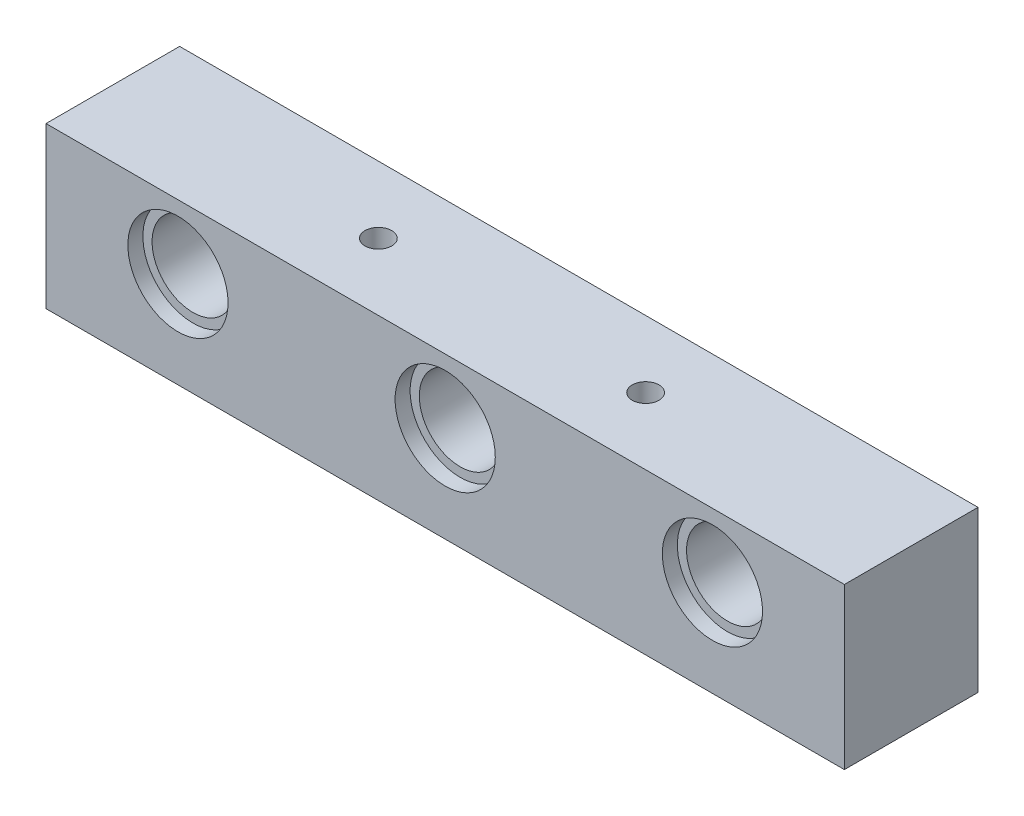
ISO-10303-21;
HEADER;
FILE_DESCRIPTION(('STEP AP214'),'2;1');
FILE_NAME('part.step','',(''),(''),'','','');
FILE_SCHEMA(('AUTOMOTIVE_DESIGN { 1 0 10303 214 1 1 1 1 }'));
ENDSEC;
DATA;
#1=APPLICATION_CONTEXT('core data for automotive mechanical design processes');
#2=APPLICATION_PROTOCOL_DEFINITION('international standard','automotive_design',2000,#1);
#3=PRODUCT_CONTEXT('',#1,'mechanical');
#4=PRODUCT('Part','Part','',(#3));
#5=PRODUCT_RELATED_PRODUCT_CATEGORY('part','',(#4));
#6=PRODUCT_DEFINITION_FORMATION('','',#4);
#7=PRODUCT_DEFINITION_CONTEXT('part definition',#1,'design');
#8=PRODUCT_DEFINITION('design','',#6,#7);
#9=PRODUCT_DEFINITION_SHAPE('','',#8);
#10=(LENGTH_UNIT() NAMED_UNIT(*) SI_UNIT(.MILLI.,.METRE.));
#11=(NAMED_UNIT(*) PLANE_ANGLE_UNIT() SI_UNIT($,.RADIAN.));
#12=(NAMED_UNIT(*) SI_UNIT($,.STERADIAN.) SOLID_ANGLE_UNIT());
#13=UNCERTAINTY_MEASURE_WITH_UNIT(LENGTH_MEASURE(1.E-05),#10,'distance_accuracy_value','');
#14=(GEOMETRIC_REPRESENTATION_CONTEXT(3) GLOBAL_UNCERTAINTY_ASSIGNED_CONTEXT((#13)) GLOBAL_UNIT_ASSIGNED_CONTEXT((#10,
#11,#12)) REPRESENTATION_CONTEXT('',''));
#15=CARTESIAN_POINT('',(0.,0.,0.));
#16=DIRECTION('',(0.,0.,1.));
#17=DIRECTION('',(1.,0.,0.));
#18=AXIS2_PLACEMENT_3D('',#15,#16,#17);
#19=CARTESIAN_POINT('',(0.,0.,-4.));
#20=DIRECTION('',(0.,0.,1.));
#21=DIRECTION('',(1.,0.,0.));
#22=AXIS2_PLACEMENT_3D('',#19,#20,#21);
#23=PLANE('',#22);
#24=CARTESIAN_POINT('',(0.,0.95,-4.));
#25=DIRECTION('',(0.,0.,1.));
#26=DIRECTION('',(1.,0.,0.));
#27=AXIS2_PLACEMENT_3D('',#24,#25,#26);
#28=CIRCLE('',#27,3.);
#29=CARTESIAN_POINT('',(3.,0.95,-4.));
#30=VERTEX_POINT('',#29);
#31=EDGE_CURVE('E151',#30,#30,#28,.T.);
#32=ORIENTED_EDGE('',*,*,#31,.T.);
#33=EDGE_LOOP('',(#32));
#34=FACE_BOUND('',#33,.T.);
#35=DIRECTION('',(0.,-1.,0.));
#36=VECTOR('',#35,1.);
#37=CARTESIAN_POINT('',(-23.9,4.8,-4.));
#38=LINE('',#37,#36);
#39=CARTESIAN_POINT('',(-23.9,4.8,-4.));
#40=VERTEX_POINT('',#39);
#41=CARTESIAN_POINT('',(-23.9,-4.8,-4.));
#42=VERTEX_POINT('',#41);
#43=EDGE_CURVE('E101',#40,#42,#38,.T.);
#44=ORIENTED_EDGE('',*,*,#43,.F.);
#45=DIRECTION('',(-1.,0.,0.));
#46=VECTOR('',#45,1.);
#47=CARTESIAN_POINT('',(-23.9,4.8,-4.));
#48=LINE('',#47,#46);
#49=CARTESIAN_POINT('',(23.9,4.8,-4.));
#50=VERTEX_POINT('',#49);
#51=EDGE_CURVE('E77',#50,#40,#48,.T.);
#52=ORIENTED_EDGE('',*,*,#51,.F.);
#53=DIRECTION('',(0.,1.,0.));
#54=VECTOR('',#53,1.);
#55=CARTESIAN_POINT('',(23.9,4.8,-4.));
#56=LINE('',#55,#54);
#57=CARTESIAN_POINT('',(23.9,-4.8,-4.));
#58=VERTEX_POINT('',#57);
#59=EDGE_CURVE('E71',#58,#50,#56,.T.);
#60=ORIENTED_EDGE('',*,*,#59,.F.);
#61=DIRECTION('',(1.,0.,0.));
#62=VECTOR('',#61,1.);
#63=CARTESIAN_POINT('',(-23.9,-4.8,-4.));
#64=LINE('',#63,#62);
#65=EDGE_CURVE('E93',#42,#58,#64,.T.);
#66=ORIENTED_EDGE('',*,*,#65,.F.);
#67=EDGE_LOOP('',(#44,#52,#60,#66));
#68=FACE_BOUND('',#67,.T.);
#69=CARTESIAN_POINT('',(-16.,0.95,-4.));
#70=DIRECTION('',(0.,0.,1.));
#71=DIRECTION('',(1.,0.,0.));
#72=AXIS2_PLACEMENT_3D('',#69,#70,#71);
#73=CIRCLE('',#72,3.);
#74=CARTESIAN_POINT('',(-13.,0.95,-4.));
#75=VERTEX_POINT('',#74);
#76=EDGE_CURVE('E142',#75,#75,#73,.T.);
#77=ORIENTED_EDGE('',*,*,#76,.T.);
#78=EDGE_LOOP('',(#77));
#79=FACE_BOUND('',#78,.T.);
#80=CARTESIAN_POINT('',(16.,0.95,-4.));
#81=DIRECTION('',(0.,0.,1.));
#82=DIRECTION('',(1.,0.,0.));
#83=AXIS2_PLACEMENT_3D('',#80,#81,#82);
#84=CIRCLE('',#83,3.);
#85=CARTESIAN_POINT('',(19.,0.95,-4.));
#86=VERTEX_POINT('',#85);
#87=EDGE_CURVE('E160',#86,#86,#84,.T.);
#88=ORIENTED_EDGE('',*,*,#87,.T.);
#89=EDGE_LOOP('',(#88));
#90=FACE_BOUND('',#89,.T.);
#91=ADVANCED_FACE('F37',(#34,#68,#79,#90),#23,.F.);
#92=CARTESIAN_POINT('',(16.,0.95,-4.));
#93=DIRECTION('',(0.,0.,1.));
#94=DIRECTION('',(1.,0.,0.));
#95=AXIS2_PLACEMENT_3D('',#92,#93,#94);
#96=CYLINDRICAL_SURFACE('',#95,2.45);
#97=CARTESIAN_POINT('',(16.,0.95,3.1));
#98=DIRECTION('',(0.,0.,1.));
#99=DIRECTION('',(1.,0.,0.));
#100=AXIS2_PLACEMENT_3D('',#97,#98,#99);
#101=CIRCLE('',#100,2.45);
#102=CARTESIAN_POINT('',(18.45,0.95,3.1));
#103=VERTEX_POINT('',#102);
#104=EDGE_CURVE('E136',#103,#103,#101,.T.);
#105=ORIENTED_EDGE('',*,*,#104,.T.);
#106=EDGE_LOOP('',(#105));
#107=FACE_BOUND('',#106,.T.);
#108=CARTESIAN_POINT('',(16.,0.95,-3.1));
#109=DIRECTION('',(0.,0.,1.));
#110=DIRECTION('',(1.,0.,0.));
#111=AXIS2_PLACEMENT_3D('',#108,#109,#110);
#112=CIRCLE('',#111,2.45);
#113=CARTESIAN_POINT('',(18.45,0.95,-3.1));
#114=VERTEX_POINT('',#113);
#115=EDGE_CURVE('E163',#114,#114,#112,.T.);
#116=ORIENTED_EDGE('',*,*,#115,.F.);
#117=EDGE_LOOP('',(#116));
#118=FACE_BOUND('',#117,.T.);
#119=ADVANCED_FACE('F261',(#107,#118),#96,.F.);
#120=CARTESIAN_POINT('',(0.,0.95,-4.));
#121=DIRECTION('',(0.,0.,1.));
#122=DIRECTION('',(1.,0.,0.));
#123=AXIS2_PLACEMENT_3D('',#120,#121,#122);
#124=CYLINDRICAL_SURFACE('',#123,2.45);
#125=CARTESIAN_POINT('',(0.,0.95,3.1));
#126=DIRECTION('',(0.,0.,1.));
#127=DIRECTION('',(1.,0.,0.));
#128=AXIS2_PLACEMENT_3D('',#125,#126,#127);
#129=CIRCLE('',#128,2.45);
#130=CARTESIAN_POINT('',(2.45,0.95,3.1));
#131=VERTEX_POINT('',#130);
#132=EDGE_CURVE('E127',#131,#131,#129,.T.);
#133=ORIENTED_EDGE('',*,*,#132,.T.);
#134=EDGE_LOOP('',(#133));
#135=FACE_BOUND('',#134,.T.);
#136=CARTESIAN_POINT('',(0.,0.95,-3.1));
#137=DIRECTION('',(0.,0.,1.));
#138=DIRECTION('',(1.,0.,0.));
#139=AXIS2_PLACEMENT_3D('',#136,#137,#138);
#140=CIRCLE('',#139,2.45);
#141=CARTESIAN_POINT('',(2.45,0.95,-3.1));
#142=VERTEX_POINT('',#141);
#143=EDGE_CURVE('E154',#142,#142,#140,.T.);
#144=ORIENTED_EDGE('',*,*,#143,.F.);
#145=EDGE_LOOP('',(#144));
#146=FACE_BOUND('',#145,.T.);
#147=ADVANCED_FACE('F269',(#135,#146),#124,.F.);
#148=CARTESIAN_POINT('',(-16.,0.95,-4.));
#149=DIRECTION('',(0.,0.,1.));
#150=DIRECTION('',(1.,0.,0.));
#151=AXIS2_PLACEMENT_3D('',#148,#149,#150);
#152=CYLINDRICAL_SURFACE('',#151,2.45);
#153=CARTESIAN_POINT('',(-16.,0.95,3.1));
#154=DIRECTION('',(0.,0.,1.));
#155=DIRECTION('',(1.,0.,0.));
#156=AXIS2_PLACEMENT_3D('',#153,#154,#155);
#157=CIRCLE('',#156,2.45);
#158=CARTESIAN_POINT('',(-13.55,0.95,3.1));
#159=VERTEX_POINT('',#158);
#160=EDGE_CURVE('E118',#159,#159,#157,.T.);
#161=ORIENTED_EDGE('',*,*,#160,.T.);
#162=EDGE_LOOP('',(#161));
#163=FACE_BOUND('',#162,.T.);
#164=CARTESIAN_POINT('',(-16.,0.95,-3.1));
#165=DIRECTION('',(0.,0.,1.));
#166=DIRECTION('',(1.,0.,0.));
#167=AXIS2_PLACEMENT_3D('',#164,#165,#166);
#168=CIRCLE('',#167,2.45);
#169=CARTESIAN_POINT('',(-13.55,0.95,-3.1));
#170=VERTEX_POINT('',#169);
#171=EDGE_CURVE('E145',#170,#170,#168,.T.);
#172=ORIENTED_EDGE('',*,*,#171,.F.);
#173=EDGE_LOOP('',(#172));
#174=FACE_BOUND('',#173,.T.);
#175=ADVANCED_FACE('F319',(#163,#174),#152,.F.);
#176=CARTESIAN_POINT('',(-23.9,4.8,4.));
#177=DIRECTION('',(1.,0.,0.));
#178=DIRECTION('',(0.,0.,-1.));
#179=AXIS2_PLACEMENT_3D('',#176,#177,#178);
#180=PLANE('',#179);
#181=ORIENTED_EDGE('',*,*,#43,.T.);
#182=DIRECTION('',(0.,0.,-1.));
#183=VECTOR('',#182,1.);
#184=CARTESIAN_POINT('',(-23.9,-4.8,4.));
#185=LINE('',#184,#183);
#186=CARTESIAN_POINT('',(-23.9,-4.8,4.));
#187=VERTEX_POINT('',#186);
#188=EDGE_CURVE('E11',#187,#42,#185,.T.);
#189=ORIENTED_EDGE('',*,*,#188,.F.);
#190=DIRECTION('',(0.,-1.,0.));
#191=VECTOR('',#190,1.);
#192=CARTESIAN_POINT('',(-23.9,4.8,4.));
#193=LINE('',#192,#191);
#194=CARTESIAN_POINT('',(-23.9,4.8,4.));
#195=VERTEX_POINT('',#194);
#196=EDGE_CURVE('E89',#195,#187,#193,.T.);
#197=ORIENTED_EDGE('',*,*,#196,.F.);
#198=DIRECTION('',(0.,0.,-1.));
#199=VECTOR('',#198,1.);
#200=CARTESIAN_POINT('',(-23.9,4.8,4.));
#201=LINE('',#200,#199);
#202=EDGE_CURVE('E97',#195,#40,#201,.T.);
#203=ORIENTED_EDGE('',*,*,#202,.T.);
#204=EDGE_LOOP('',(#181,#189,#197,#203));
#205=FACE_BOUND('',#204,.T.);
#206=ADVANCED_FACE('F39',(#205),#180,.F.);
#207=CARTESIAN_POINT('',(-23.9,-4.8,4.));
#208=DIRECTION('',(0.,1.,0.));
#209=DIRECTION('',(0.,0.,1.));
#210=AXIS2_PLACEMENT_3D('',#207,#208,#209);
#211=PLANE('',#210);
#212=CARTESIAN_POINT('',(20.,-4.8,0.));
#213=DIRECTION('',(0.,-1.,0.));
#214=DIRECTION('',(0.,0.,-1.));
#215=AXIS2_PLACEMENT_3D('',#212,#213,#214);
#216=CIRCLE('',#215,2.45);
#217=CARTESIAN_POINT('',(20.,-4.8,-2.45));
#218=VERTEX_POINT('',#217);
#219=EDGE_CURVE('E211',#218,#218,#216,.T.);
#220=ORIENTED_EDGE('',*,*,#219,.F.);
#221=EDGE_LOOP('',(#220));
#222=FACE_BOUND('',#221,.T.);
#223=CARTESIAN_POINT('',(12.,-4.8,0.));
#224=DIRECTION('',(0.,-1.,0.));
#225=DIRECTION('',(0.,0.,-1.));
#226=AXIS2_PLACEMENT_3D('',#223,#224,#225);
#227=CIRCLE('',#226,2.45);
#228=CARTESIAN_POINT('',(12.,-4.8,-2.45));
#229=VERTEX_POINT('',#228);
#230=EDGE_CURVE('E205',#229,#229,#227,.T.);
#231=ORIENTED_EDGE('',*,*,#230,.F.);
#232=EDGE_LOOP('',(#231));
#233=FACE_BOUND('',#232,.T.);
#234=CARTESIAN_POINT('',(4.,-4.8,0.));
#235=DIRECTION('',(0.,-1.,0.));
#236=DIRECTION('',(0.,0.,-1.));
#237=AXIS2_PLACEMENT_3D('',#234,#235,#236);
#238=CIRCLE('',#237,2.45);
#239=CARTESIAN_POINT('',(4.,-4.8,-2.45));
#240=VERTEX_POINT('',#239);
#241=EDGE_CURVE('E199',#240,#240,#238,.T.);
#242=ORIENTED_EDGE('',*,*,#241,.F.);
#243=EDGE_LOOP('',(#242));
#244=FACE_BOUND('',#243,.T.);
#245=CARTESIAN_POINT('',(-12.,-4.8,0.));
#246=DIRECTION('',(0.,-1.,0.));
#247=DIRECTION('',(0.,0.,-1.));
#248=AXIS2_PLACEMENT_3D('',#245,#246,#247);
#249=CIRCLE('',#248,2.45);
#250=CARTESIAN_POINT('',(-12.,-4.8,-2.45));
#251=VERTEX_POINT('',#250);
#252=EDGE_CURVE('E193',#251,#251,#249,.T.);
#253=ORIENTED_EDGE('',*,*,#252,.F.);
#254=EDGE_LOOP('',(#253));
#255=FACE_BOUND('',#254,.T.);
#256=CARTESIAN_POINT('',(-4.,-4.8,0.));
#257=DIRECTION('',(0.,-1.,0.));
#258=DIRECTION('',(0.,0.,-1.));
#259=AXIS2_PLACEMENT_3D('',#256,#257,#258);
#260=CIRCLE('',#259,2.45);
#261=CARTESIAN_POINT('',(-4.,-4.8,-2.45));
#262=VERTEX_POINT('',#261);
#263=EDGE_CURVE('E187',#262,#262,#260,.T.);
#264=ORIENTED_EDGE('',*,*,#263,.F.);
#265=EDGE_LOOP('',(#264));
#266=FACE_BOUND('',#265,.T.);
#267=CARTESIAN_POINT('',(-20.,-4.8,0.));
#268=DIRECTION('',(0.,-1.,0.));
#269=DIRECTION('',(0.,0.,-1.));
#270=AXIS2_PLACEMENT_3D('',#267,#268,#269);
#271=CIRCLE('',#270,2.45);
#272=CARTESIAN_POINT('',(-20.,-4.8,-2.45));
#273=VERTEX_POINT('',#272);
#274=EDGE_CURVE('E181',#273,#273,#271,.T.);
#275=ORIENTED_EDGE('',*,*,#274,.F.);
#276=EDGE_LOOP('',(#275));
#277=FACE_BOUND('',#276,.T.);
#278=CARTESIAN_POINT('',(8.,-4.8,0.));
#279=DIRECTION('',(0.,-1.,0.));
#280=DIRECTION('',(0.,0.,-1.));
#281=AXIS2_PLACEMENT_3D('',#278,#279,#280);
#282=CIRCLE('',#281,0.799999999999988);
#283=CARTESIAN_POINT('',(8.,-4.8,-0.799999999999987));
#284=VERTEX_POINT('',#283);
#285=EDGE_CURVE('E177',#284,#284,#282,.T.);
#286=ORIENTED_EDGE('',*,*,#285,.F.);
#287=EDGE_LOOP('',(#286));
#288=FACE_BOUND('',#287,.T.);
#289=CARTESIAN_POINT('',(-8.,-4.8,0.));
#290=DIRECTION('',(0.,-1.,0.));
#291=DIRECTION('',(0.,0.,-1.));
#292=AXIS2_PLACEMENT_3D('',#289,#290,#291);
#293=CIRCLE('',#292,0.799999999999988);
#294=CARTESIAN_POINT('',(-8.,-4.8,-0.799999999999987));
#295=VERTEX_POINT('',#294);
#296=EDGE_CURVE('E171',#295,#295,#293,.T.);
#297=ORIENTED_EDGE('',*,*,#296,.F.);
#298=EDGE_LOOP('',(#297));
#299=FACE_BOUND('',#298,.T.);
#300=ORIENTED_EDGE('',*,*,#65,.T.);
#301=DIRECTION('',(0.,0.,-1.));
#302=VECTOR('',#301,1.);
#303=CARTESIAN_POINT('',(23.9,-4.8,4.));
#304=LINE('',#303,#302);
#305=CARTESIAN_POINT('',(23.9,-4.8,4.));
#306=VERTEX_POINT('',#305);
#307=EDGE_CURVE('E46',#306,#58,#304,.T.);
#308=ORIENTED_EDGE('',*,*,#307,.F.);
#309=DIRECTION('',(1.,0.,0.));
#310=VECTOR('',#309,1.);
#311=CARTESIAN_POINT('',(-23.9,-4.8,4.));
#312=LINE('',#311,#310);
#313=EDGE_CURVE('E84',#187,#306,#312,.T.);
#314=ORIENTED_EDGE('',*,*,#313,.F.);
#315=ORIENTED_EDGE('',*,*,#188,.T.);
#316=EDGE_LOOP('',(#300,#308,#314,#315));
#317=FACE_BOUND('',#316,.T.);
#318=ADVANCED_FACE('F92',(#222,#233,#244,#255,#266,#277,#288,#299,#317),#211,.F.);
#319=CARTESIAN_POINT('',(23.9,4.8,4.));
#320=DIRECTION('',(-1.,0.,0.));
#321=DIRECTION('',(0.,0.,1.));
#322=AXIS2_PLACEMENT_3D('',#319,#320,#321);
#323=PLANE('',#322);
#324=ORIENTED_EDGE('',*,*,#59,.T.);
#325=DIRECTION('',(0.,0.,-1.));
#326=VECTOR('',#325,1.);
#327=CARTESIAN_POINT('',(23.9,4.8,4.));
#328=LINE('',#327,#326);
#329=CARTESIAN_POINT('',(23.9,4.8,4.));
#330=VERTEX_POINT('',#329);
#331=EDGE_CURVE('E94',#330,#50,#328,.T.);
#332=ORIENTED_EDGE('',*,*,#331,.F.);
#333=DIRECTION('',(0.,1.,0.));
#334=VECTOR('',#333,1.);
#335=CARTESIAN_POINT('',(23.9,4.8,4.));
#336=LINE('',#335,#334);
#337=EDGE_CURVE('E87',#306,#330,#336,.T.);
#338=ORIENTED_EDGE('',*,*,#337,.F.);
#339=ORIENTED_EDGE('',*,*,#307,.T.);
#340=EDGE_LOOP('',(#324,#332,#338,#339));
#341=FACE_BOUND('',#340,.T.);
#342=ADVANCED_FACE('F95',(#341),#323,.F.);
#343=CARTESIAN_POINT('',(-23.9,4.8,4.));
#344=DIRECTION('',(0.,-1.,0.));
#345=DIRECTION('',(0.,0.,-1.));
#346=AXIS2_PLACEMENT_3D('',#343,#344,#345);
#347=PLANE('',#346);
#348=CARTESIAN_POINT('',(8.,4.8,0.));
#349=DIRECTION('',(0.,-1.,0.));
#350=DIRECTION('',(0.,0.,-1.));
#351=AXIS2_PLACEMENT_3D('',#348,#349,#350);
#352=CIRCLE('',#351,0.799999999999999);
#353=CARTESIAN_POINT('',(8.,4.8,-0.799999999999998));
#354=VERTEX_POINT('',#353);
#355=EDGE_CURVE('E174',#354,#354,#352,.T.);
#356=ORIENTED_EDGE('',*,*,#355,.T.);
#357=EDGE_LOOP('',(#356));
#358=FACE_BOUND('',#357,.T.);
#359=CARTESIAN_POINT('',(-8.,4.8,0.));
#360=DIRECTION('',(0.,-1.,0.));
#361=DIRECTION('',(0.,0.,-1.));
#362=AXIS2_PLACEMENT_3D('',#359,#360,#361);
#363=CIRCLE('',#362,0.799999999999998);
#364=CARTESIAN_POINT('',(-8.,4.8,-0.799999999999997));
#365=VERTEX_POINT('',#364);
#366=EDGE_CURVE('E168',#365,#365,#363,.T.);
#367=ORIENTED_EDGE('',*,*,#366,.T.);
#368=EDGE_LOOP('',(#367));
#369=FACE_BOUND('',#368,.T.);
#370=ORIENTED_EDGE('',*,*,#51,.T.);
#371=ORIENTED_EDGE('',*,*,#202,.F.);
#372=DIRECTION('',(-1.,0.,0.));
#373=VECTOR('',#372,1.);
#374=CARTESIAN_POINT('',(-23.9,4.8,4.));
#375=LINE('',#374,#373);
#376=EDGE_CURVE('E54',#330,#195,#375,.T.);
#377=ORIENTED_EDGE('',*,*,#376,.F.);
#378=ORIENTED_EDGE('',*,*,#331,.T.);
#379=EDGE_LOOP('',(#370,#371,#377,#378));
#380=FACE_BOUND('',#379,.T.);
#381=ADVANCED_FACE('F109',(#358,#369,#380),#347,.F.);
#382=CARTESIAN_POINT('',(0.,0.,4.));
#383=DIRECTION('',(0.,0.,1.));
#384=DIRECTION('',(1.,0.,0.));
#385=AXIS2_PLACEMENT_3D('',#382,#383,#384);
#386=PLANE('',#385);
#387=CARTESIAN_POINT('',(16.,0.95,4.));
#388=DIRECTION('',(0.,0.,1.));
#389=DIRECTION('',(1.,0.,0.));
#390=AXIS2_PLACEMENT_3D('',#387,#388,#389);
#391=CIRCLE('',#390,3.);
#392=CARTESIAN_POINT('',(19.,0.95,4.));
#393=VERTEX_POINT('',#392);
#394=EDGE_CURVE('E133',#393,#393,#391,.T.);
#395=ORIENTED_EDGE('',*,*,#394,.F.);
#396=EDGE_LOOP('',(#395));
#397=FACE_BOUND('',#396,.T.);
#398=CARTESIAN_POINT('',(0.,0.95,4.));
#399=DIRECTION('',(0.,0.,1.));
#400=DIRECTION('',(1.,0.,0.));
#401=AXIS2_PLACEMENT_3D('',#398,#399,#400);
#402=CIRCLE('',#401,3.);
#403=CARTESIAN_POINT('',(3.,0.95,4.));
#404=VERTEX_POINT('',#403);
#405=EDGE_CURVE('E124',#404,#404,#402,.T.);
#406=ORIENTED_EDGE('',*,*,#405,.F.);
#407=EDGE_LOOP('',(#406));
#408=FACE_BOUND('',#407,.T.);
#409=CARTESIAN_POINT('',(-16.,0.95,4.));
#410=DIRECTION('',(0.,0.,1.));
#411=DIRECTION('',(1.,0.,0.));
#412=AXIS2_PLACEMENT_3D('',#409,#410,#411);
#413=CIRCLE('',#412,3.);
#414=CARTESIAN_POINT('',(-13.,0.95,4.));
#415=VERTEX_POINT('',#414);
#416=EDGE_CURVE('E115',#415,#415,#413,.T.);
#417=ORIENTED_EDGE('',*,*,#416,.F.);
#418=EDGE_LOOP('',(#417));
#419=FACE_BOUND('',#418,.T.);
#420=ORIENTED_EDGE('',*,*,#196,.T.);
#421=ORIENTED_EDGE('',*,*,#313,.T.);
#422=ORIENTED_EDGE('',*,*,#337,.T.);
#423=ORIENTED_EDGE('',*,*,#376,.T.);
#424=EDGE_LOOP('',(#420,#421,#422,#423));
#425=FACE_BOUND('',#424,.T.);
#426=ADVANCED_FACE('F85',(#397,#408,#419,#425),#386,.T.);
#427=CARTESIAN_POINT('',(-16.,0.95,3.1));
#428=DIRECTION('',(0.,0.,1.));
#429=DIRECTION('',(1.,0.,0.));
#430=AXIS2_PLACEMENT_3D('',#427,#428,#429);
#431=CYLINDRICAL_SURFACE('',#430,3.);
#432=CARTESIAN_POINT('',(-16.,0.95,3.1));
#433=DIRECTION('',(0.,0.,1.));
#434=DIRECTION('',(1.,0.,0.));
#435=AXIS2_PLACEMENT_3D('',#432,#433,#434);
#436=CIRCLE('',#435,3.);
#437=CARTESIAN_POINT('',(-13.,0.95,3.1));
#438=VERTEX_POINT('',#437);
#439=EDGE_CURVE('E104',#438,#438,#436,.T.);
#440=ORIENTED_EDGE('',*,*,#439,.F.);
#441=EDGE_LOOP('',(#440));
#442=FACE_BOUND('',#441,.T.);
#443=ORIENTED_EDGE('',*,*,#416,.T.);
#444=EDGE_LOOP('',(#443));
#445=FACE_BOUND('',#444,.T.);
#446=ADVANCED_FACE('F301',(#442,#445),#431,.F.);
#447=CARTESIAN_POINT('',(-16.,0.95,3.1));
#448=DIRECTION('',(0.,0.,1.));
#449=DIRECTION('',(1.,0.,0.));
#450=AXIS2_PLACEMENT_3D('',#447,#448,#449);
#451=PLANE('',#450);
#452=ORIENTED_EDGE('',*,*,#160,.F.);
#453=EDGE_LOOP('',(#452));
#454=FACE_BOUND('',#453,.T.);
#455=ORIENTED_EDGE('',*,*,#439,.T.);
#456=EDGE_LOOP('',(#455));
#457=FACE_BOUND('',#456,.T.);
#458=ADVANCED_FACE('F333',(#454,#457),#451,.T.);
#459=CARTESIAN_POINT('',(0.,0.95,3.1));
#460=DIRECTION('',(0.,0.,1.));
#461=DIRECTION('',(1.,0.,0.));
#462=AXIS2_PLACEMENT_3D('',#459,#460,#461);
#463=CYLINDRICAL_SURFACE('',#462,3.);
#464=CARTESIAN_POINT('',(0.,0.95,3.1));
#465=DIRECTION('',(0.,0.,1.));
#466=DIRECTION('',(1.,0.,0.));
#467=AXIS2_PLACEMENT_3D('',#464,#465,#466);
#468=CIRCLE('',#467,3.);
#469=CARTESIAN_POINT('',(3.,0.95,3.1));
#470=VERTEX_POINT('',#469);
#471=EDGE_CURVE('E123',#470,#470,#468,.T.);
#472=ORIENTED_EDGE('',*,*,#471,.F.);
#473=EDGE_LOOP('',(#472));
#474=FACE_BOUND('',#473,.T.);
#475=ORIENTED_EDGE('',*,*,#405,.T.);
#476=EDGE_LOOP('',(#475));
#477=FACE_BOUND('',#476,.T.);
#478=ADVANCED_FACE('F340',(#474,#477),#463,.F.);
#479=CARTESIAN_POINT('',(0.,0.95,3.1));
#480=DIRECTION('',(0.,0.,1.));
#481=DIRECTION('',(1.,0.,0.));
#482=AXIS2_PLACEMENT_3D('',#479,#480,#481);
#483=PLANE('',#482);
#484=ORIENTED_EDGE('',*,*,#132,.F.);
#485=EDGE_LOOP('',(#484));
#486=FACE_BOUND('',#485,.T.);
#487=ORIENTED_EDGE('',*,*,#471,.T.);
#488=EDGE_LOOP('',(#487));
#489=FACE_BOUND('',#488,.T.);
#490=ADVANCED_FACE('F348',(#486,#489),#483,.T.);
#491=CARTESIAN_POINT('',(16.,0.95,3.1));
#492=DIRECTION('',(0.,0.,1.));
#493=DIRECTION('',(1.,0.,0.));
#494=AXIS2_PLACEMENT_3D('',#491,#492,#493);
#495=CYLINDRICAL_SURFACE('',#494,3.);
#496=CARTESIAN_POINT('',(16.,0.95,3.1));
#497=DIRECTION('',(0.,0.,1.));
#498=DIRECTION('',(1.,0.,0.));
#499=AXIS2_PLACEMENT_3D('',#496,#497,#498);
#500=CIRCLE('',#499,3.);
#501=CARTESIAN_POINT('',(19.,0.95,3.1));
#502=VERTEX_POINT('',#501);
#503=EDGE_CURVE('E132',#502,#502,#500,.T.);
#504=ORIENTED_EDGE('',*,*,#503,.F.);
#505=EDGE_LOOP('',(#504));
#506=FACE_BOUND('',#505,.T.);
#507=ORIENTED_EDGE('',*,*,#394,.T.);
#508=EDGE_LOOP('',(#507));
#509=FACE_BOUND('',#508,.T.);
#510=ADVANCED_FACE('F356',(#506,#509),#495,.F.);
#511=CARTESIAN_POINT('',(16.,0.95,3.1));
#512=DIRECTION('',(0.,0.,1.));
#513=DIRECTION('',(1.,0.,0.));
#514=AXIS2_PLACEMENT_3D('',#511,#512,#513);
#515=PLANE('',#514);
#516=ORIENTED_EDGE('',*,*,#104,.F.);
#517=EDGE_LOOP('',(#516));
#518=FACE_BOUND('',#517,.T.);
#519=ORIENTED_EDGE('',*,*,#503,.T.);
#520=EDGE_LOOP('',(#519));
#521=FACE_BOUND('',#520,.T.);
#522=ADVANCED_FACE('F364',(#518,#521),#515,.T.);
#523=CARTESIAN_POINT('',(-16.,0.95,-3.1));
#524=DIRECTION('',(0.,0.,-1.));
#525=DIRECTION('',(1.,0.,0.));
#526=AXIS2_PLACEMENT_3D('',#523,#524,#525);
#527=PLANE('',#526);
#528=CARTESIAN_POINT('',(-16.,0.95,-3.1));
#529=DIRECTION('',(0.,0.,1.));
#530=DIRECTION('',(1.,0.,0.));
#531=AXIS2_PLACEMENT_3D('',#528,#529,#530);
#532=CIRCLE('',#531,3.);
#533=CARTESIAN_POINT('',(-13.,0.95,-3.1));
#534=VERTEX_POINT('',#533);
#535=EDGE_CURVE('E141',#534,#534,#532,.T.);
#536=ORIENTED_EDGE('',*,*,#535,.F.);
#537=EDGE_LOOP('',(#536));
#538=FACE_BOUND('',#537,.T.);
#539=ORIENTED_EDGE('',*,*,#171,.T.);
#540=EDGE_LOOP('',(#539));
#541=FACE_BOUND('',#540,.T.);
#542=ADVANCED_FACE('F371',(#538,#541),#527,.T.);
#543=CARTESIAN_POINT('',(-16.,0.95,-3.1));
#544=DIRECTION('',(0.,0.,-1.));
#545=DIRECTION('',(-1.,0.,0.));
#546=AXIS2_PLACEMENT_3D('',#543,#544,#545);
#547=CYLINDRICAL_SURFACE('',#546,3.);
#548=ORIENTED_EDGE('',*,*,#535,.T.);
#549=EDGE_LOOP('',(#548));
#550=FACE_BOUND('',#549,.T.);
#551=ORIENTED_EDGE('',*,*,#76,.F.);
#552=EDGE_LOOP('',(#551));
#553=FACE_BOUND('',#552,.T.);
#554=ADVANCED_FACE('F378',(#550,#553),#547,.F.);
#555=CARTESIAN_POINT('',(0.,0.95,-3.1));
#556=DIRECTION('',(0.,0.,-1.));
#557=DIRECTION('',(1.,0.,0.));
#558=AXIS2_PLACEMENT_3D('',#555,#556,#557);
#559=PLANE('',#558);
#560=CARTESIAN_POINT('',(0.,0.95,-3.1));
#561=DIRECTION('',(0.,0.,1.));
#562=DIRECTION('',(1.,0.,0.));
#563=AXIS2_PLACEMENT_3D('',#560,#561,#562);
#564=CIRCLE('',#563,3.);
#565=CARTESIAN_POINT('',(3.,0.95,-3.1));
#566=VERTEX_POINT('',#565);
#567=EDGE_CURVE('E150',#566,#566,#564,.T.);
#568=ORIENTED_EDGE('',*,*,#567,.F.);
#569=EDGE_LOOP('',(#568));
#570=FACE_BOUND('',#569,.T.);
#571=ORIENTED_EDGE('',*,*,#143,.T.);
#572=EDGE_LOOP('',(#571));
#573=FACE_BOUND('',#572,.T.);
#574=ADVANCED_FACE('F385',(#570,#573),#559,.T.);
#575=CARTESIAN_POINT('',(0.,0.95,-3.1));
#576=DIRECTION('',(0.,0.,-1.));
#577=DIRECTION('',(-1.,0.,0.));
#578=AXIS2_PLACEMENT_3D('',#575,#576,#577);
#579=CYLINDRICAL_SURFACE('',#578,3.);
#580=ORIENTED_EDGE('',*,*,#567,.T.);
#581=EDGE_LOOP('',(#580));
#582=FACE_BOUND('',#581,.T.);
#583=ORIENTED_EDGE('',*,*,#31,.F.);
#584=EDGE_LOOP('',(#583));
#585=FACE_BOUND('',#584,.T.);
#586=ADVANCED_FACE('F393',(#582,#585),#579,.F.);
#587=CARTESIAN_POINT('',(16.,0.95,-3.1));
#588=DIRECTION('',(0.,0.,-1.));
#589=DIRECTION('',(1.,0.,0.));
#590=AXIS2_PLACEMENT_3D('',#587,#588,#589);
#591=PLANE('',#590);
#592=CARTESIAN_POINT('',(16.,0.95,-3.1));
#593=DIRECTION('',(0.,0.,1.));
#594=DIRECTION('',(1.,0.,0.));
#595=AXIS2_PLACEMENT_3D('',#592,#593,#594);
#596=CIRCLE('',#595,3.);
#597=CARTESIAN_POINT('',(19.,0.95,-3.1));
#598=VERTEX_POINT('',#597);
#599=EDGE_CURVE('E159',#598,#598,#596,.T.);
#600=ORIENTED_EDGE('',*,*,#599,.F.);
#601=EDGE_LOOP('',(#600));
#602=FACE_BOUND('',#601,.T.);
#603=ORIENTED_EDGE('',*,*,#115,.T.);
#604=EDGE_LOOP('',(#603));
#605=FACE_BOUND('',#604,.T.);
#606=ADVANCED_FACE('F255',(#602,#605),#591,.T.);
#607=CARTESIAN_POINT('',(16.,0.95,-3.1));
#608=DIRECTION('',(0.,0.,-1.));
#609=DIRECTION('',(-1.,0.,0.));
#610=AXIS2_PLACEMENT_3D('',#607,#608,#609);
#611=CYLINDRICAL_SURFACE('',#610,3.);
#612=ORIENTED_EDGE('',*,*,#599,.T.);
#613=EDGE_LOOP('',(#612));
#614=FACE_BOUND('',#613,.T.);
#615=ORIENTED_EDGE('',*,*,#87,.F.);
#616=EDGE_LOOP('',(#615));
#617=FACE_BOUND('',#616,.T.);
#618=ADVANCED_FACE('F245',(#614,#617),#611,.F.);
#619=CARTESIAN_POINT('',(-8.,-4.8,0.));
#620=DIRECTION('',(0.,-1.,0.));
#621=DIRECTION('',(0.,0.,-1.));
#622=AXIS2_PLACEMENT_3D('',#619,#620,#621);
#623=CYLINDRICAL_SURFACE('',#622,0.799999999999993);
#624=ORIENTED_EDGE('',*,*,#366,.F.);
#625=EDGE_LOOP('',(#624));
#626=FACE_BOUND('',#625,.T.);
#627=ORIENTED_EDGE('',*,*,#296,.T.);
#628=EDGE_LOOP('',(#627));
#629=FACE_BOUND('',#628,.T.);
#630=ADVANCED_FACE('F242',(#626,#629),#623,.F.);
#631=CARTESIAN_POINT('',(8.,-4.8,0.));
#632=DIRECTION('',(0.,-1.,0.));
#633=DIRECTION('',(0.,0.,-1.));
#634=AXIS2_PLACEMENT_3D('',#631,#632,#633);
#635=CYLINDRICAL_SURFACE('',#634,0.799999999999993);
#636=ORIENTED_EDGE('',*,*,#355,.F.);
#637=EDGE_LOOP('',(#636));
#638=FACE_BOUND('',#637,.T.);
#639=ORIENTED_EDGE('',*,*,#285,.T.);
#640=EDGE_LOOP('',(#639));
#641=FACE_BOUND('',#640,.T.);
#642=ADVANCED_FACE('F244',(#638,#641),#635,.F.);
#643=CARTESIAN_POINT('',(-20.,-2.8,0.));
#644=DIRECTION('',(0.,-1.,0.));
#645=DIRECTION('',(0.,0.,-1.));
#646=AXIS2_PLACEMENT_3D('',#643,#644,#645);
#647=CYLINDRICAL_SURFACE('',#646,2.45);
#648=CARTESIAN_POINT('',(-20.,-2.8,0.));
#649=DIRECTION('',(0.,-1.,0.));
#650=DIRECTION('',(0.,0.,-1.));
#651=AXIS2_PLACEMENT_3D('',#648,#649,#650);
#652=CIRCLE('',#651,2.45);
#653=CARTESIAN_POINT('',(-20.,-2.8,-2.45));
#654=VERTEX_POINT('',#653);
#655=EDGE_CURVE('E180',#654,#654,#652,.T.);
#656=ORIENTED_EDGE('',*,*,#655,.F.);
#657=EDGE_LOOP('',(#656));
#658=FACE_BOUND('',#657,.T.);
#659=ORIENTED_EDGE('',*,*,#274,.T.);
#660=EDGE_LOOP('',(#659));
#661=FACE_BOUND('',#660,.T.);
#662=ADVANCED_FACE('F252',(#658,#661),#647,.F.);
#663=CARTESIAN_POINT('',(-20.,-2.8,0.));
#664=DIRECTION('',(0.,-1.,0.));
#665=DIRECTION('',(0.,0.,-1.));
#666=AXIS2_PLACEMENT_3D('',#663,#664,#665);
#667=PLANE('',#666);
#668=ORIENTED_EDGE('',*,*,#655,.T.);
#669=EDGE_LOOP('',(#668));
#670=FACE_BOUND('',#669,.T.);
#671=ADVANCED_FACE('F433',(#670),#667,.T.);
#672=CARTESIAN_POINT('',(-4.,-2.8,0.));
#673=DIRECTION('',(0.,-1.,0.));
#674=DIRECTION('',(0.,0.,-1.));
#675=AXIS2_PLACEMENT_3D('',#672,#673,#674);
#676=CYLINDRICAL_SURFACE('',#675,2.45);
#677=CARTESIAN_POINT('',(-4.,-2.8,0.));
#678=DIRECTION('',(0.,-1.,0.));
#679=DIRECTION('',(0.,0.,-1.));
#680=AXIS2_PLACEMENT_3D('',#677,#678,#679);
#681=CIRCLE('',#680,2.45);
#682=CARTESIAN_POINT('',(-4.,-2.8,-2.45));
#683=VERTEX_POINT('',#682);
#684=EDGE_CURVE('E184',#683,#683,#681,.T.);
#685=ORIENTED_EDGE('',*,*,#684,.F.);
#686=EDGE_LOOP('',(#685));
#687=FACE_BOUND('',#686,.T.);
#688=ORIENTED_EDGE('',*,*,#263,.T.);
#689=EDGE_LOOP('',(#688));
#690=FACE_BOUND('',#689,.T.);
#691=ADVANCED_FACE('F442',(#687,#690),#676,.F.);
#692=CARTESIAN_POINT('',(-4.,-2.8,0.));
#693=DIRECTION('',(0.,-1.,0.));
#694=DIRECTION('',(0.,0.,-1.));
#695=AXIS2_PLACEMENT_3D('',#692,#693,#694);
#696=PLANE('',#695);
#697=ORIENTED_EDGE('',*,*,#684,.T.);
#698=EDGE_LOOP('',(#697));
#699=FACE_BOUND('',#698,.T.);
#700=ADVANCED_FACE('F451',(#699),#696,.T.);
#701=CARTESIAN_POINT('',(-12.,-2.8,0.));
#702=DIRECTION('',(0.,-1.,0.));
#703=DIRECTION('',(0.,0.,-1.));
#704=AXIS2_PLACEMENT_3D('',#701,#702,#703);
#705=CYLINDRICAL_SURFACE('',#704,2.45);
#706=CARTESIAN_POINT('',(-12.,-2.8,0.));
#707=DIRECTION('',(0.,-1.,0.));
#708=DIRECTION('',(0.,0.,-1.));
#709=AXIS2_PLACEMENT_3D('',#706,#707,#708);
#710=CIRCLE('',#709,2.45);
#711=CARTESIAN_POINT('',(-12.,-2.8,-2.45));
#712=VERTEX_POINT('',#711);
#713=EDGE_CURVE('E190',#712,#712,#710,.T.);
#714=ORIENTED_EDGE('',*,*,#713,.F.);
#715=EDGE_LOOP('',(#714));
#716=FACE_BOUND('',#715,.T.);
#717=ORIENTED_EDGE('',*,*,#252,.T.);
#718=EDGE_LOOP('',(#717));
#719=FACE_BOUND('',#718,.T.);
#720=ADVANCED_FACE('F460',(#716,#719),#705,.F.);
#721=CARTESIAN_POINT('',(-12.,-2.8,0.));
#722=DIRECTION('',(0.,-1.,0.));
#723=DIRECTION('',(0.,0.,-1.));
#724=AXIS2_PLACEMENT_3D('',#721,#722,#723);
#725=PLANE('',#724);
#726=ORIENTED_EDGE('',*,*,#713,.T.);
#727=EDGE_LOOP('',(#726));
#728=FACE_BOUND('',#727,.T.);
#729=ADVANCED_FACE('F469',(#728),#725,.T.);
#730=CARTESIAN_POINT('',(4.,-2.8,0.));
#731=DIRECTION('',(0.,-1.,0.));
#732=DIRECTION('',(0.,0.,-1.));
#733=AXIS2_PLACEMENT_3D('',#730,#731,#732);
#734=CYLINDRICAL_SURFACE('',#733,2.45);
#735=CARTESIAN_POINT('',(4.,-2.8,0.));
#736=DIRECTION('',(0.,-1.,0.));
#737=DIRECTION('',(0.,0.,-1.));
#738=AXIS2_PLACEMENT_3D('',#735,#736,#737);
#739=CIRCLE('',#738,2.45);
#740=CARTESIAN_POINT('',(4.,-2.8,-2.45));
#741=VERTEX_POINT('',#740);
#742=EDGE_CURVE('E196',#741,#741,#739,.T.);
#743=ORIENTED_EDGE('',*,*,#742,.F.);
#744=EDGE_LOOP('',(#743));
#745=FACE_BOUND('',#744,.T.);
#746=ORIENTED_EDGE('',*,*,#241,.T.);
#747=EDGE_LOOP('',(#746));
#748=FACE_BOUND('',#747,.T.);
#749=ADVANCED_FACE('F478',(#745,#748),#734,.F.);
#750=CARTESIAN_POINT('',(4.,-2.8,0.));
#751=DIRECTION('',(0.,-1.,0.));
#752=DIRECTION('',(0.,0.,-1.));
#753=AXIS2_PLACEMENT_3D('',#750,#751,#752);
#754=PLANE('',#753);
#755=ORIENTED_EDGE('',*,*,#742,.T.);
#756=EDGE_LOOP('',(#755));
#757=FACE_BOUND('',#756,.T.);
#758=ADVANCED_FACE('F487',(#757),#754,.T.);
#759=CARTESIAN_POINT('',(12.,-2.8,0.));
#760=DIRECTION('',(0.,-1.,0.));
#761=DIRECTION('',(0.,0.,-1.));
#762=AXIS2_PLACEMENT_3D('',#759,#760,#761);
#763=CYLINDRICAL_SURFACE('',#762,2.45);
#764=CARTESIAN_POINT('',(12.,-2.8,0.));
#765=DIRECTION('',(0.,-1.,0.));
#766=DIRECTION('',(0.,0.,-1.));
#767=AXIS2_PLACEMENT_3D('',#764,#765,#766);
#768=CIRCLE('',#767,2.45);
#769=CARTESIAN_POINT('',(12.,-2.8,-2.45));
#770=VERTEX_POINT('',#769);
#771=EDGE_CURVE('E202',#770,#770,#768,.T.);
#772=ORIENTED_EDGE('',*,*,#771,.F.);
#773=EDGE_LOOP('',(#772));
#774=FACE_BOUND('',#773,.T.);
#775=ORIENTED_EDGE('',*,*,#230,.T.);
#776=EDGE_LOOP('',(#775));
#777=FACE_BOUND('',#776,.T.);
#778=ADVANCED_FACE('F496',(#774,#777),#763,.F.);
#779=CARTESIAN_POINT('',(12.,-2.8,0.));
#780=DIRECTION('',(0.,-1.,0.));
#781=DIRECTION('',(0.,0.,-1.));
#782=AXIS2_PLACEMENT_3D('',#779,#780,#781);
#783=PLANE('',#782);
#784=ORIENTED_EDGE('',*,*,#771,.T.);
#785=EDGE_LOOP('',(#784));
#786=FACE_BOUND('',#785,.T.);
#787=ADVANCED_FACE('F222',(#786),#783,.T.);
#788=CARTESIAN_POINT('',(20.,-2.8,0.));
#789=DIRECTION('',(0.,-1.,0.));
#790=DIRECTION('',(0.,0.,-1.));
#791=AXIS2_PLACEMENT_3D('',#788,#789,#790);
#792=CYLINDRICAL_SURFACE('',#791,2.45);
#793=CARTESIAN_POINT('',(20.,-2.8,0.));
#794=DIRECTION('',(0.,-1.,0.));
#795=DIRECTION('',(0.,0.,-1.));
#796=AXIS2_PLACEMENT_3D('',#793,#794,#795);
#797=CIRCLE('',#796,2.45);
#798=CARTESIAN_POINT('',(20.,-2.8,-2.45));
#799=VERTEX_POINT('',#798);
#800=EDGE_CURVE('E208',#799,#799,#797,.T.);
#801=ORIENTED_EDGE('',*,*,#800,.F.);
#802=EDGE_LOOP('',(#801));
#803=FACE_BOUND('',#802,.T.);
#804=ORIENTED_EDGE('',*,*,#219,.T.);
#805=EDGE_LOOP('',(#804));
#806=FACE_BOUND('',#805,.T.);
#807=ADVANCED_FACE('F219',(#803,#806),#792,.F.);
#808=CARTESIAN_POINT('',(20.,-2.8,0.));
#809=DIRECTION('',(0.,-1.,0.));
#810=DIRECTION('',(0.,0.,-1.));
#811=AXIS2_PLACEMENT_3D('',#808,#809,#810);
#812=PLANE('',#811);
#813=ORIENTED_EDGE('',*,*,#800,.T.);
#814=EDGE_LOOP('',(#813));
#815=FACE_BOUND('',#814,.T.);
#816=ADVANCED_FACE('F217',(#815),#812,.T.);
#817=CLOSED_SHELL('',(#91,#119,#147,#175,#206,#318,#342,#381,#426,#446,#458,#478,#490,#510,#522,
#542,#554,#574,#586,#606,#618,#630,#642,#662,#671,#691,#700,#720,#729,#749,#758,#778,#787,#807,#816));
#818=MANIFOLD_SOLID_BREP('B2',#817);
#819=ADVANCED_BREP_SHAPE_REPRESENTATION('',(#18,#818),#14);
#820=SHAPE_DEFINITION_REPRESENTATION(#9,#819);
ENDSEC;
END-ISO-10303-21;
